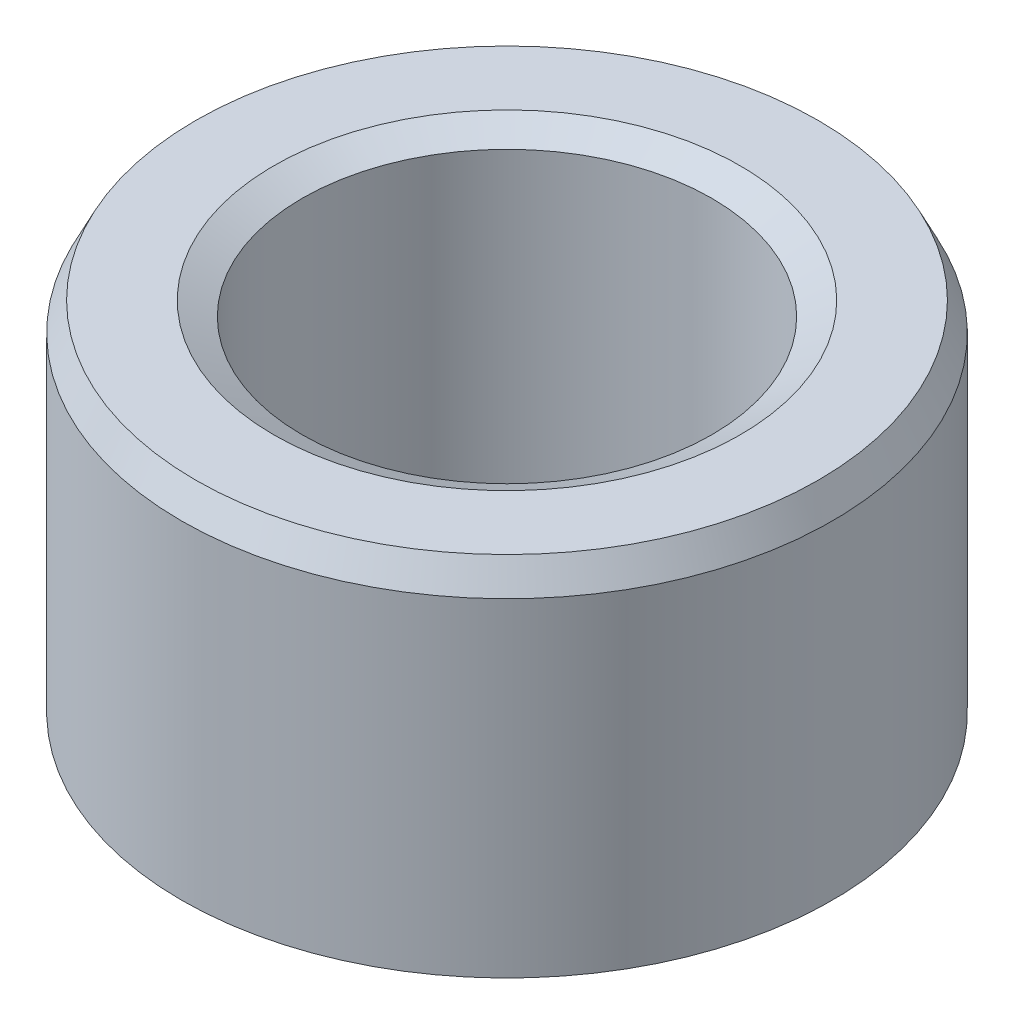
ISO-10303-21;
HEADER;
FILE_DESCRIPTION(('STEP AP214'),'2;1');
FILE_NAME('part.step','',(''),(''),'','','');
FILE_SCHEMA(('AUTOMOTIVE_DESIGN { 1 0 10303 214 1 1 1 1 }'));
ENDSEC;
DATA;
#1=APPLICATION_CONTEXT('core data for automotive mechanical design processes');
#2=APPLICATION_PROTOCOL_DEFINITION('international standard','automotive_design',2000,#1);
#3=PRODUCT_CONTEXT('',#1,'mechanical');
#4=PRODUCT('Part','Part','',(#3));
#5=PRODUCT_RELATED_PRODUCT_CATEGORY('part','',(#4));
#6=PRODUCT_DEFINITION_FORMATION('','',#4);
#7=PRODUCT_DEFINITION_CONTEXT('part definition',#1,'design');
#8=PRODUCT_DEFINITION('design','',#6,#7);
#9=PRODUCT_DEFINITION_SHAPE('','',#8);
#10=(LENGTH_UNIT() NAMED_UNIT(*) SI_UNIT(.MILLI.,.METRE.));
#11=(NAMED_UNIT(*) PLANE_ANGLE_UNIT() SI_UNIT($,.RADIAN.));
#12=(NAMED_UNIT(*) SI_UNIT($,.STERADIAN.) SOLID_ANGLE_UNIT());
#13=UNCERTAINTY_MEASURE_WITH_UNIT(LENGTH_MEASURE(1.E-05),#10,'distance_accuracy_value','');
#14=(GEOMETRIC_REPRESENTATION_CONTEXT(3) GLOBAL_UNCERTAINTY_ASSIGNED_CONTEXT((#13)) GLOBAL_UNIT_ASSIGNED_CONTEXT((#10,
#11,#12)) REPRESENTATION_CONTEXT('',''));
#15=CARTESIAN_POINT('',(0.,0.,0.));
#16=DIRECTION('',(0.,0.,1.));
#17=DIRECTION('',(1.,0.,0.));
#18=AXIS2_PLACEMENT_3D('',#15,#16,#17);
#19=CARTESIAN_POINT('',(0.,11.3932262212586,0.));
#20=DIRECTION('',(0.,-1.,0.));
#21=DIRECTION('',(0.,0.,-1.));
#22=AXIS2_PLACEMENT_3D('',#19,#20,#21);
#23=CYLINDRICAL_SURFACE('',#22,10.);
#24=CARTESIAN_POINT('',(0.,0.432113114226175,0.));
#25=DIRECTION('',(0.,1.,0.));
#26=DIRECTION('',(0.,0.,1.));
#27=AXIS2_PLACEMENT_3D('',#24,#25,#26);
#28=CIRCLE('',#27,10.);
#29=CARTESIAN_POINT('',(0.,0.432113114226175,10.));
#30=VERTEX_POINT('',#29);
#31=EDGE_CURVE('E10',#30,#30,#28,.T.);
#32=ORIENTED_EDGE('',*,*,#31,.T.);
#33=EDGE_LOOP('',(#32));
#34=FACE_BOUND('',#33,.T.);
#35=CARTESIAN_POINT('',(0.,10.522947549742,0.));
#36=DIRECTION('',(0.,1.,0.));
#37=DIRECTION('',(0.,0.,1.));
#38=AXIS2_PLACEMENT_3D('',#35,#36,#37);
#39=CIRCLE('',#38,10.);
#40=CARTESIAN_POINT('',(0.,10.522947549742,10.));
#41=VERTEX_POINT('',#40);
#42=EDGE_CURVE('E50',#41,#41,#39,.F.);
#43=ORIENTED_EDGE('',*,*,#42,.T.);
#44=EDGE_LOOP('',(#43));
#45=FACE_BOUND('',#44,.T.);
#46=ADVANCED_FACE('F39',(#34,#45),#23,.T.);
#47=CARTESIAN_POINT('',(0.,11.3932262212586,0.));
#48=DIRECTION('',(0.,1.,0.));
#49=DIRECTION('',(0.,0.,1.));
#50=AXIS2_PLACEMENT_3D('',#47,#48,#49);
#51=PLANE('',#50);
#52=CARTESIAN_POINT('',(0.,11.3932262212586,0.));
#53=DIRECTION('',(0.,1.,0.));
#54=DIRECTION('',(0.,0.,1.));
#55=AXIS2_PLACEMENT_3D('',#52,#53,#54);
#56=CIRCLE('',#55,7.16343744565372);
#57=CARTESIAN_POINT('',(0.,11.3932262212586,7.16343744565372));
#58=VERTEX_POINT('',#57);
#59=EDGE_CURVE('E58',#58,#58,#56,.F.);
#60=ORIENTED_EDGE('',*,*,#59,.T.);
#61=EDGE_LOOP('',(#60));
#62=FACE_BOUND('',#61,.T.);
#63=CARTESIAN_POINT('',(0.,11.3932262212586,0.));
#64=DIRECTION('',(0.,1.,0.));
#65=DIRECTION('',(0.,0.,1.));
#66=AXIS2_PLACEMENT_3D('',#63,#64,#65);
#67=CIRCLE('',#66,9.56788688577383);
#68=CARTESIAN_POINT('',(0.,11.3932262212586,9.56788688577383));
#69=VERTEX_POINT('',#68);
#70=EDGE_CURVE('E61',#69,#69,#67,.T.);
#71=ORIENTED_EDGE('',*,*,#70,.T.);
#72=EDGE_LOOP('',(#71));
#73=FACE_BOUND('',#72,.T.);
#74=ADVANCED_FACE('F88',(#62,#73),#51,.T.);
#75=CARTESIAN_POINT('',(0.,0.,0.));
#76=DIRECTION('',(0.,1.,0.));
#77=DIRECTION('',(0.,0.,1.));
#78=AXIS2_PLACEMENT_3D('',#75,#76,#77);
#79=PLANE('',#78);
#80=CARTESIAN_POINT('',(0.,0.,0.));
#81=DIRECTION('',(0.,1.,0.));
#82=DIRECTION('',(0.,0.,1.));
#83=AXIS2_PLACEMENT_3D('',#80,#81,#82);
#84=CIRCLE('',#83,6.72527188836331);
#85=CARTESIAN_POINT('',(0.,0.,6.72527188836331));
#86=VERTEX_POINT('',#85);
#87=EDGE_CURVE('E51',#86,#86,#84,.T.);
#88=ORIENTED_EDGE('',*,*,#87,.T.);
#89=EDGE_LOOP('',(#88));
#90=FACE_BOUND('',#89,.T.);
#91=CARTESIAN_POINT('',(0.,0.,0.));
#92=DIRECTION('',(0.,1.,0.));
#93=DIRECTION('',(0.,0.,1.));
#94=AXIS2_PLACEMENT_3D('',#91,#92,#93);
#95=CIRCLE('',#94,9.1297213284834);
#96=CARTESIAN_POINT('',(0.,0.,9.1297213284834));
#97=VERTEX_POINT('',#96);
#98=EDGE_CURVE('E54',#97,#97,#95,.F.);
#99=ORIENTED_EDGE('',*,*,#98,.T.);
#100=EDGE_LOOP('',(#99));
#101=FACE_BOUND('',#100,.T.);
#102=ADVANCED_FACE('F83',(#90,#101),#79,.F.);
#103=CARTESIAN_POINT('',(0.,11.3932262212586,0.));
#104=DIRECTION('',(0.,-1.,0.));
#105=DIRECTION('',(0.,0.,-1.));
#106=AXIS2_PLACEMENT_3D('',#103,#104,#105);
#107=CYLINDRICAL_SURFACE('',#106,6.29315877413714);
#108=CARTESIAN_POINT('',(0.,10.9611131070324,0.));
#109=DIRECTION('',(0.,1.,0.));
#110=DIRECTION('',(0.,0.,1.));
#111=AXIS2_PLACEMENT_3D('',#108,#109,#110);
#112=CIRCLE('',#111,6.29315877413714);
#113=CARTESIAN_POINT('',(0.,10.9611131070324,6.29315877413714));
#114=VERTEX_POINT('',#113);
#115=EDGE_CURVE('E67',#114,#114,#112,.T.);
#116=ORIENTED_EDGE('',*,*,#115,.T.);
#117=EDGE_LOOP('',(#116));
#118=FACE_BOUND('',#117,.T.);
#119=CARTESIAN_POINT('',(0.,0.870278671516589,0.));
#120=DIRECTION('',(0.,1.,0.));
#121=DIRECTION('',(0.,0.,1.));
#122=AXIS2_PLACEMENT_3D('',#119,#120,#121);
#123=CIRCLE('',#122,6.29315877413714);
#124=CARTESIAN_POINT('',(0.,0.870278671516589,6.29315877413714));
#125=VERTEX_POINT('',#124);
#126=EDGE_CURVE('E69',#125,#125,#123,.F.);
#127=ORIENTED_EDGE('',*,*,#126,.T.);
#128=EDGE_LOOP('',(#127));
#129=FACE_BOUND('',#128,.T.);
#130=ADVANCED_FACE('F71',(#118,#129),#107,.F.);
#131=CARTESIAN_POINT('',(0.,10.9611131070324,0.));
#132=DIRECTION('',(0.,1.,0.));
#133=DIRECTION('',(0.,0.,1.));
#134=AXIS2_PLACEMENT_3D('',#131,#132,#133);
#135=CONICAL_SURFACE('',#134,6.29315877413714,1.10993442668428);
#136=CARTESIAN_POINT('',(0.,11.3932262212586,7.16343744565372));
#137=CARTESIAN_POINT('',(0.,11.3887250429854,7.15437204282542));
#138=CARTESIAN_POINT('',(0.,11.3842238647122,7.14530663999713));
#139=CARTESIAN_POINT('',(0.,11.3752215081658,7.12717583434053));
#140=CARTESIAN_POINT('',(0.,11.3707203298926,7.11811043151223));
#141=CARTESIAN_POINT('',(0.,11.3617179733462,7.09997962585564));
#142=CARTESIAN_POINT('',(0.,11.357216795073,7.09091422302734));
#143=CARTESIAN_POINT('',(0.,11.3482144385267,7.07278341737074));
#144=CARTESIAN_POINT('',(0.,11.3437132602535,7.06371801454245));
#145=CARTESIAN_POINT('',(0.,11.3347109037071,7.04558720888585));
#146=CARTESIAN_POINT('',(0.,11.3302097254339,7.03652180605755));
#147=CARTESIAN_POINT('',(0.,11.3212073688875,7.01839100040096));
#148=CARTESIAN_POINT('',(0.,11.3167061906143,7.00932559757266));
#149=CARTESIAN_POINT('',(0.,11.307703834068,6.99119479191607));
#150=CARTESIAN_POINT('',(0.,11.3032026557948,6.98212938908777));
#151=CARTESIAN_POINT('',(0.,11.2942002992484,6.96399858343117));
#152=CARTESIAN_POINT('',(0.,11.2896991209752,6.95493318060287));
#153=CARTESIAN_POINT('',(0.,11.2806967644288,6.93680237494628));
#154=CARTESIAN_POINT('',(0.,11.2761955861556,6.92773697211798));
#155=CARTESIAN_POINT('',(0.,11.2671932296093,6.90960616646139));
#156=CARTESIAN_POINT('',(0.,11.2626920513361,6.90054076363309));
#157=CARTESIAN_POINT('',(0.,11.2536896947897,6.88240995797649));
#158=CARTESIAN_POINT('',(0.,11.2491885165165,6.87334455514819));
#159=CARTESIAN_POINT('',(0.,11.2401861599701,6.8552137494916));
#160=CARTESIAN_POINT('',(0.,11.2356849816969,6.8461483466633));
#161=CARTESIAN_POINT('',(0.,11.2266826251506,6.82801754100671));
#162=CARTESIAN_POINT('',(0.,11.2221814468774,6.81895213817841));
#163=CARTESIAN_POINT('',(0.,11.213179090331,6.80082133252181));
#164=CARTESIAN_POINT('',(0.,11.2086779120578,6.79175592969351));
#165=CARTESIAN_POINT('',(0.,11.1996755555114,6.77362512403692));
#166=CARTESIAN_POINT('',(0.,11.1951743772382,6.76455972120862));
#167=CARTESIAN_POINT('',(0.,11.1861720206918,6.74642891555203));
#168=CARTESIAN_POINT('',(0.,11.1816708424187,6.73736351272373));
#169=CARTESIAN_POINT('',(0.,11.1726684858723,6.71923270706713));
#170=CARTESIAN_POINT('',(0.,11.1681673075991,6.71016730423883));
#171=CARTESIAN_POINT('',(0.,11.1591649510527,6.69203649858224));
#172=CARTESIAN_POINT('',(0.,11.1546637727795,6.68297109575394));
#173=CARTESIAN_POINT('',(0.,11.1456614162331,6.66484029009735));
#174=CARTESIAN_POINT('',(0.,11.14116023796,6.65577488726905));
#175=CARTESIAN_POINT('',(0.,11.1321578814136,6.63764408161245));
#176=CARTESIAN_POINT('',(0.,11.1276567031404,6.62857867878416));
#177=CARTESIAN_POINT('',(0.,11.118654346594,6.61044787312756));
#178=CARTESIAN_POINT('',(0.,11.1141531683208,6.60138247029926));
#179=CARTESIAN_POINT('',(0.,11.1051508117744,6.58325166464267));
#180=CARTESIAN_POINT('',(0.,11.1006496335013,6.57418626181437));
#181=CARTESIAN_POINT('',(0.,11.0916472769549,6.55605545615777));
#182=CARTESIAN_POINT('',(0.,11.0871460986817,6.54699005332948));
#183=CARTESIAN_POINT('',(0.,11.0781437421353,6.52885924767288));
#184=CARTESIAN_POINT('',(0.,11.0736425638621,6.51979384484458));
#185=CARTESIAN_POINT('',(0.,11.0646402073157,6.50166303918799));
#186=CARTESIAN_POINT('',(0.,11.0601390290425,6.49259763635969));
#187=CARTESIAN_POINT('',(0.,11.0511366724962,6.47446683070309));
#188=CARTESIAN_POINT('',(0.,11.046635494223,6.4654014278748));
#189=CARTESIAN_POINT('',(0.,11.0376331376766,6.4472706222182));
#190=CARTESIAN_POINT('',(0.,11.0331319594034,6.4382052193899));
#191=CARTESIAN_POINT('',(0.,11.024129602857,6.42007441373331));
#192=CARTESIAN_POINT('',(0.,11.0196284245838,6.41100901090501));
#193=CARTESIAN_POINT('',(0.,11.0106260680375,6.39287820524841));
#194=CARTESIAN_POINT('',(0.,11.0061248897643,6.38381280242012));
#195=CARTESIAN_POINT('',(0.,10.9971225332179,6.36568199676352));
#196=CARTESIAN_POINT('',(0.,10.9926213549447,6.35661659393522));
#197=CARTESIAN_POINT('',(0.,10.9836189983983,6.33848578827863));
#198=CARTESIAN_POINT('',(0.,10.9791178201251,6.32942038545033));
#199=CARTESIAN_POINT('',(0.,10.9701154635788,6.31128957979373));
#200=CARTESIAN_POINT('',(0.,10.9656142853056,6.30222417696544));
#201=CARTESIAN_POINT('',(0.,10.9611131070324,6.29315877413714));
#202=B_SPLINE_CURVE_WITH_KNOTS('',3,(#136,#137,#138,#139,#140,#141,#142,#143,#144,#145,#146,
#147,#148,#149,#150,#151,#152,#153,#154,#155,#156,#157,#158,#159,#160,#161,#162,#163,#164,#165,
#166,#167,#168,#169,#170,#171,#172,#173,#174,#175,#176,#177,#178,#179,#180,#181,#182,#183,#184,
#185,#186,#187,#188,#189,#190,#191,#192,#193,#194,#195,#196,#197,#198,#199,#200,#201),
.UNSPECIFIED.,.F.,.F.,(4,2,2,2,2,2,2,2,2,2,2,2,2,2,2,2,2,2,2,2,2,2,2,2,2,2,2,2,2,2,2,2,4),(0.,
0.0303641105349235,0.060728221069847,0.0910923316047705,0.121456442139694,0.151820552674618,
0.182184663209542,0.212548773744465,0.242912884279389,0.273276994814312,0.303641105349236,
0.334005215884159,0.364369326419084,0.394733436954006,0.425097547488931,0.455461658023853,
0.485825768558778,0.516189879093702,0.546553989628625,0.576918100163549,0.607282210698472,
0.637646321233396,0.668010431768319,0.698374542303243,0.728738652838167,0.759102763373091,
0.789466873908014,0.819830984442938,0.850195094977861,0.880559205512785,0.910923316047708,
0.941287426582632,0.971651537117555),.UNSPECIFIED.);
#203=EDGE_CURVE('BSEAM77',#58,#114,#202,.T.);
#204=ORIENTED_EDGE('',*,*,#59,.F.);
#205=ORIENTED_EDGE('',*,*,#115,.F.);
#206=ORIENTED_EDGE('',*,*,#203,.T.);
#207=ORIENTED_EDGE('',*,*,#203,.F.);
#208=EDGE_LOOP('',(#204,#206,#205,#207));
#209=FACE_BOUND('',#208,.T.);
#210=ADVANCED_FACE('F77',(#209),#135,.F.);
#211=CARTESIAN_POINT('',(0.,0.,0.));
#212=DIRECTION('',(0.,-1.,0.));
#213=DIRECTION('',(0.,0.,-1.));
#214=AXIS2_PLACEMENT_3D('',#211,#212,#213);
#215=CONICAL_SURFACE('',#214,6.72527188836331,0.460861900110618);
#216=ORIENTED_EDGE('',*,*,#126,.F.);
#217=EDGE_LOOP('',(#216));
#218=FACE_BOUND('',#217,.T.);
#219=ORIENTED_EDGE('',*,*,#87,.F.);
#220=EDGE_LOOP('',(#219));
#221=FACE_BOUND('',#220,.T.);
#222=ADVANCED_FACE('F73',(#218,#221),#215,.F.);
#223=CARTESIAN_POINT('',(0.,0.432113114226175,0.));
#224=DIRECTION('',(0.,1.,0.));
#225=DIRECTION('',(0.,0.,1.));
#226=AXIS2_PLACEMENT_3D('',#223,#224,#225);
#227=CONICAL_SURFACE('',#226,10.,1.10993442668428);
#228=ORIENTED_EDGE('',*,*,#98,.F.);
#229=EDGE_LOOP('',(#228));
#230=FACE_BOUND('',#229,.T.);
#231=ORIENTED_EDGE('',*,*,#31,.F.);
#232=EDGE_LOOP('',(#231));
#233=FACE_BOUND('',#232,.T.);
#234=ADVANCED_FACE('F76',(#230,#233),#227,.T.);
#235=CARTESIAN_POINT('',(0.,11.3932262212586,0.));
#236=DIRECTION('',(0.,-1.,0.));
#237=DIRECTION('',(0.,0.,-1.));
#238=AXIS2_PLACEMENT_3D('',#235,#236,#237);
#239=CONICAL_SURFACE('',#238,9.56788688577383,0.460861900110618);
#240=ORIENTED_EDGE('',*,*,#42,.F.);
#241=EDGE_LOOP('',(#240));
#242=FACE_BOUND('',#241,.T.);
#243=ORIENTED_EDGE('',*,*,#70,.F.);
#244=EDGE_LOOP('',(#243));
#245=FACE_BOUND('',#244,.T.);
#246=ADVANCED_FACE('F45',(#242,#245),#239,.T.);
#247=CLOSED_SHELL('',(#46,#74,#102,#130,#210,#222,#234,#246));
#248=MANIFOLD_SOLID_BREP('B2',#247);
#249=ADVANCED_BREP_SHAPE_REPRESENTATION('',(#18,#248),#14);
#250=SHAPE_DEFINITION_REPRESENTATION(#9,#249);
ENDSEC;
END-ISO-10303-21;
